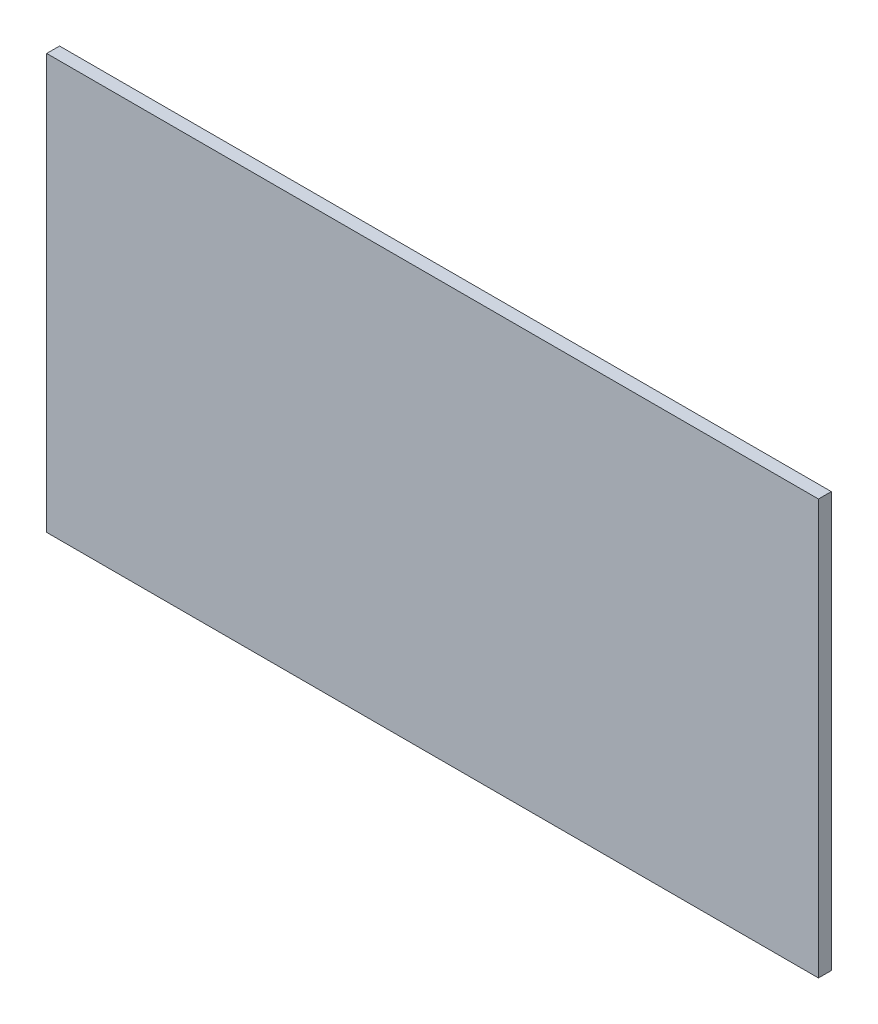
ISO-10303-21;
HEADER;
FILE_DESCRIPTION(('STEP AP214'),'2;1');
FILE_NAME('part.step','',(''),(''),'','','');
FILE_SCHEMA(('AUTOMOTIVE_DESIGN { 1 0 10303 214 1 1 1 1 }'));
ENDSEC;
DATA;
#1=APPLICATION_CONTEXT('core data for automotive mechanical design processes');
#2=APPLICATION_PROTOCOL_DEFINITION('international standard','automotive_design',2000,#1);
#3=PRODUCT_CONTEXT('',#1,'mechanical');
#4=PRODUCT('Part','Part','',(#3));
#5=PRODUCT_RELATED_PRODUCT_CATEGORY('part','',(#4));
#6=PRODUCT_DEFINITION_FORMATION('','',#4);
#7=PRODUCT_DEFINITION_CONTEXT('part definition',#1,'design');
#8=PRODUCT_DEFINITION('design','',#6,#7);
#9=PRODUCT_DEFINITION_SHAPE('','',#8);
#10=(LENGTH_UNIT() NAMED_UNIT(*) SI_UNIT(.MILLI.,.METRE.));
#11=(NAMED_UNIT(*) PLANE_ANGLE_UNIT() SI_UNIT($,.RADIAN.));
#12=(NAMED_UNIT(*) SI_UNIT($,.STERADIAN.) SOLID_ANGLE_UNIT());
#13=UNCERTAINTY_MEASURE_WITH_UNIT(LENGTH_MEASURE(1.E-05),#10,'distance_accuracy_value','');
#14=(GEOMETRIC_REPRESENTATION_CONTEXT(3) GLOBAL_UNCERTAINTY_ASSIGNED_CONTEXT((#13)) GLOBAL_UNIT_ASSIGNED_CONTEXT((#10,
#11,#12)) REPRESENTATION_CONTEXT('',''));
#15=CARTESIAN_POINT('',(0.,0.,0.));
#16=DIRECTION('',(0.,0.,1.));
#17=DIRECTION('',(1.,0.,0.));
#18=AXIS2_PLACEMENT_3D('',#15,#16,#17);
#19=CARTESIAN_POINT('',(-71.2686448209439,22.3938829787234,20.));
#20=DIRECTION('',(1.,0.,0.));
#21=DIRECTION('',(0.,1.,0.));
#22=AXIS2_PLACEMENT_3D('',#19,#20,#21);
#23=PLANE('',#22);
#24=DIRECTION('',(0.,-1.,0.));
#25=VECTOR('',#24,1.);
#26=CARTESIAN_POINT('',(-71.2686448209439,22.3938829787234,0.));
#27=LINE('',#26,#25);
#28=CARTESIAN_POINT('',(-71.2686448209439,22.3938829787234,0.));
#29=VERTEX_POINT('',#28);
#30=CARTESIAN_POINT('',(-71.2686448209438,-622.606117021277,0.));
#31=VERTEX_POINT('',#30);
#32=EDGE_CURVE('E96',#29,#31,#27,.T.);
#33=ORIENTED_EDGE('',*,*,#32,.T.);
#34=DIRECTION('',(0.,0.,-1.));
#35=VECTOR('',#34,1.);
#36=CARTESIAN_POINT('',(-71.2686448209438,-622.606117021277,20.));
#37=LINE('',#36,#35);
#38=CARTESIAN_POINT('',(-71.2686448209438,-622.606117021277,20.));
#39=VERTEX_POINT('',#38);
#40=EDGE_CURVE('E11',#39,#31,#37,.T.);
#41=ORIENTED_EDGE('',*,*,#40,.F.);
#42=DIRECTION('',(0.,-1.,0.));
#43=VECTOR('',#42,1.);
#44=CARTESIAN_POINT('',(-71.2686448209439,22.3938829787234,20.));
#45=LINE('',#44,#43);
#46=CARTESIAN_POINT('',(-71.2686448209439,22.3938829787234,20.));
#47=VERTEX_POINT('',#46);
#48=EDGE_CURVE('E84',#47,#39,#45,.T.);
#49=ORIENTED_EDGE('',*,*,#48,.F.);
#50=DIRECTION('',(0.,0.,-1.));
#51=VECTOR('',#50,1.);
#52=CARTESIAN_POINT('',(-71.2686448209439,22.3938829787234,20.));
#53=LINE('',#52,#51);
#54=EDGE_CURVE('E92',#47,#29,#53,.T.);
#55=ORIENTED_EDGE('',*,*,#54,.T.);
#56=EDGE_LOOP('',(#33,#41,#49,#55));
#57=FACE_BOUND('',#56,.T.);
#58=ADVANCED_FACE('F33',(#57),#23,.F.);
#59=CARTESIAN_POINT('',(-71.2686448209438,-622.606117021277,20.));
#60=DIRECTION('',(0.,1.,0.));
#61=DIRECTION('',(0.,0.,1.));
#62=AXIS2_PLACEMENT_3D('',#59,#60,#61);
#63=PLANE('',#62);
#64=DIRECTION('',(1.,0.,0.));
#65=VECTOR('',#64,1.);
#66=CARTESIAN_POINT('',(-71.2686448209438,-622.606117021277,0.));
#67=LINE('',#66,#65);
#68=CARTESIAN_POINT('',(1128.73135517906,-622.606117021277,0.));
#69=VERTEX_POINT('',#68);
#70=EDGE_CURVE('E88',#31,#69,#67,.T.);
#71=ORIENTED_EDGE('',*,*,#70,.T.);
#72=DIRECTION('',(0.,0.,-1.));
#73=VECTOR('',#72,1.);
#74=CARTESIAN_POINT('',(1128.73135517906,-622.606117021277,20.));
#75=LINE('',#74,#73);
#76=CARTESIAN_POINT('',(1128.73135517906,-622.606117021277,20.));
#77=VERTEX_POINT('',#76);
#78=EDGE_CURVE('E41',#77,#69,#75,.T.);
#79=ORIENTED_EDGE('',*,*,#78,.F.);
#80=DIRECTION('',(1.,0.,0.));
#81=VECTOR('',#80,1.);
#82=CARTESIAN_POINT('',(-71.2686448209438,-622.606117021277,20.));
#83=LINE('',#82,#81);
#84=EDGE_CURVE('E79',#39,#77,#83,.T.);
#85=ORIENTED_EDGE('',*,*,#84,.F.);
#86=ORIENTED_EDGE('',*,*,#40,.T.);
#87=EDGE_LOOP('',(#71,#79,#85,#86));
#88=FACE_BOUND('',#87,.T.);
#89=ADVANCED_FACE('F87',(#88),#63,.F.);
#90=CARTESIAN_POINT('',(1128.73135517906,22.3938829787234,20.));
#91=DIRECTION('',(-1.,0.,0.));
#92=DIRECTION('',(0.,0.,1.));
#93=AXIS2_PLACEMENT_3D('',#90,#91,#92);
#94=PLANE('',#93);
#95=DIRECTION('',(0.,1.,0.));
#96=VECTOR('',#95,1.);
#97=CARTESIAN_POINT('',(1128.73135517906,22.3938829787234,0.));
#98=LINE('',#97,#96);
#99=CARTESIAN_POINT('',(1128.73135517906,22.3938829787234,0.));
#100=VERTEX_POINT('',#99);
#101=EDGE_CURVE('E66',#69,#100,#98,.T.);
#102=ORIENTED_EDGE('',*,*,#101,.T.);
#103=DIRECTION('',(0.,0.,-1.));
#104=VECTOR('',#103,1.);
#105=CARTESIAN_POINT('',(1128.73135517906,22.3938829787234,20.));
#106=LINE('',#105,#104);
#107=CARTESIAN_POINT('',(1128.73135517906,22.3938829787234,20.));
#108=VERTEX_POINT('',#107);
#109=EDGE_CURVE('E89',#108,#100,#106,.T.);
#110=ORIENTED_EDGE('',*,*,#109,.F.);
#111=DIRECTION('',(0.,1.,0.));
#112=VECTOR('',#111,1.);
#113=CARTESIAN_POINT('',(1128.73135517906,22.3938829787234,20.));
#114=LINE('',#113,#112);
#115=EDGE_CURVE('E82',#77,#108,#114,.T.);
#116=ORIENTED_EDGE('',*,*,#115,.F.);
#117=ORIENTED_EDGE('',*,*,#78,.T.);
#118=EDGE_LOOP('',(#102,#110,#116,#117));
#119=FACE_BOUND('',#118,.T.);
#120=ADVANCED_FACE('F90',(#119),#94,.F.);
#121=CARTESIAN_POINT('',(-71.2686448209439,22.3938829787234,20.));
#122=DIRECTION('',(0.,-1.,0.));
#123=DIRECTION('',(0.,0.,-1.));
#124=AXIS2_PLACEMENT_3D('',#121,#122,#123);
#125=PLANE('',#124);
#126=DIRECTION('',(-1.,0.,0.));
#127=VECTOR('',#126,1.);
#128=CARTESIAN_POINT('',(-71.2686448209439,22.3938829787234,0.));
#129=LINE('',#128,#127);
#130=EDGE_CURVE('E72',#100,#29,#129,.T.);
#131=ORIENTED_EDGE('',*,*,#130,.T.);
#132=ORIENTED_EDGE('',*,*,#54,.F.);
#133=DIRECTION('',(-1.,0.,0.));
#134=VECTOR('',#133,1.);
#135=CARTESIAN_POINT('',(-71.2686448209439,22.3938829787234,20.));
#136=LINE('',#135,#134);
#137=EDGE_CURVE('E49',#108,#47,#136,.T.);
#138=ORIENTED_EDGE('',*,*,#137,.F.);
#139=ORIENTED_EDGE('',*,*,#109,.T.);
#140=EDGE_LOOP('',(#131,#132,#138,#139));
#141=FACE_BOUND('',#140,.T.);
#142=ADVANCED_FACE('F103',(#141),#125,.F.);
#143=CARTESIAN_POINT('',(0.,0.,20.));
#144=DIRECTION('',(0.,0.,1.));
#145=DIRECTION('',(1.,0.,0.));
#146=AXIS2_PLACEMENT_3D('',#143,#144,#145);
#147=PLANE('',#146);
#148=ORIENTED_EDGE('',*,*,#48,.T.);
#149=ORIENTED_EDGE('',*,*,#84,.T.);
#150=ORIENTED_EDGE('',*,*,#115,.T.);
#151=ORIENTED_EDGE('',*,*,#137,.T.);
#152=EDGE_LOOP('',(#148,#149,#150,#151));
#153=FACE_BOUND('',#152,.T.);
#154=ADVANCED_FACE('F80',(#153),#147,.T.);
#155=CARTESIAN_POINT('',(0.,0.,0.));
#156=DIRECTION('',(0.,0.,1.));
#157=DIRECTION('',(1.,0.,0.));
#158=AXIS2_PLACEMENT_3D('',#155,#156,#157);
#159=PLANE('',#158);
#160=ORIENTED_EDGE('',*,*,#32,.F.);
#161=ORIENTED_EDGE('',*,*,#130,.F.);
#162=ORIENTED_EDGE('',*,*,#101,.F.);
#163=ORIENTED_EDGE('',*,*,#70,.F.);
#164=EDGE_LOOP('',(#160,#161,#162,#163));
#165=FACE_BOUND('',#164,.T.);
#166=ADVANCED_FACE('F106',(#165),#159,.F.);
#167=CLOSED_SHELL('',(#58,#89,#120,#142,#154,#166));
#168=MANIFOLD_SOLID_BREP('B2',#167);
#169=ADVANCED_BREP_SHAPE_REPRESENTATION('',(#18,#168),#14);
#170=SHAPE_DEFINITION_REPRESENTATION(#9,#169);
ENDSEC;
END-ISO-10303-21;
